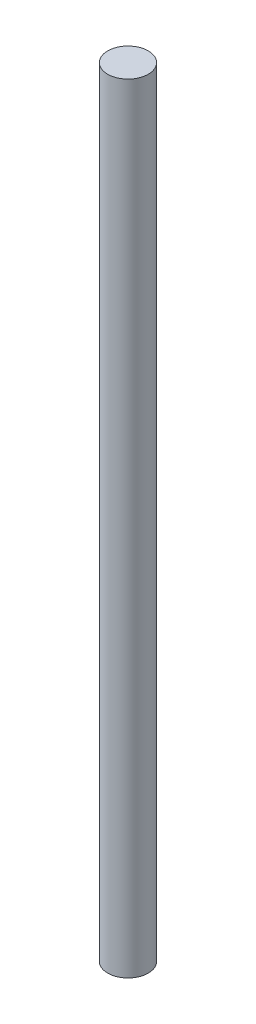
ISO-10303-21;
HEADER;
FILE_DESCRIPTION(('STEP AP214'),'2;1');
FILE_NAME('part.step','',(''),(''),'','','');
FILE_SCHEMA(('AUTOMOTIVE_DESIGN { 1 0 10303 214 1 1 1 1 }'));
ENDSEC;
DATA;
#1=APPLICATION_CONTEXT('core data for automotive mechanical design processes');
#2=APPLICATION_PROTOCOL_DEFINITION('international standard','automotive_design',2000,#1);
#3=PRODUCT_CONTEXT('',#1,'mechanical');
#4=PRODUCT('Part','Part','',(#3));
#5=PRODUCT_RELATED_PRODUCT_CATEGORY('part','',(#4));
#6=PRODUCT_DEFINITION_FORMATION('','',#4);
#7=PRODUCT_DEFINITION_CONTEXT('part definition',#1,'design');
#8=PRODUCT_DEFINITION('design','',#6,#7);
#9=PRODUCT_DEFINITION_SHAPE('','',#8);
#10=(LENGTH_UNIT() NAMED_UNIT(*) SI_UNIT(.MILLI.,.METRE.));
#11=(NAMED_UNIT(*) PLANE_ANGLE_UNIT() SI_UNIT($,.RADIAN.));
#12=(NAMED_UNIT(*) SI_UNIT($,.STERADIAN.) SOLID_ANGLE_UNIT());
#13=UNCERTAINTY_MEASURE_WITH_UNIT(LENGTH_MEASURE(1.E-05),#10,'distance_accuracy_value','');
#14=(GEOMETRIC_REPRESENTATION_CONTEXT(3) GLOBAL_UNCERTAINTY_ASSIGNED_CONTEXT((#13)) GLOBAL_UNIT_ASSIGNED_CONTEXT((#10,
#11,#12)) REPRESENTATION_CONTEXT('',''));
#15=CARTESIAN_POINT('',(0.,0.,0.));
#16=DIRECTION('',(0.,0.,1.));
#17=DIRECTION('',(1.,0.,0.));
#18=AXIS2_PLACEMENT_3D('',#15,#16,#17);
#19=CARTESIAN_POINT('',(0.,152.4,0.));
#20=DIRECTION('',(0.,-1.,0.));
#21=DIRECTION('',(0.,0.,-1.));
#22=AXIS2_PLACEMENT_3D('',#19,#20,#21);
#23=CYLINDRICAL_SURFACE('',#22,3.96875);
#24=CARTESIAN_POINT('',(0.,152.4,0.));
#25=DIRECTION('',(0.,1.,0.));
#26=DIRECTION('',(0.,0.,1.));
#27=AXIS2_PLACEMENT_3D('',#24,#25,#26);
#28=CIRCLE('',#27,3.96875);
#29=CARTESIAN_POINT('',(0.,152.4,3.96875));
#30=VERTEX_POINT('',#29);
#31=EDGE_CURVE('E10',#30,#30,#28,.T.);
#32=ORIENTED_EDGE('',*,*,#31,.F.);
#33=EDGE_LOOP('',(#32));
#34=FACE_BOUND('',#33,.T.);
#35=CARTESIAN_POINT('',(0.,0.,0.));
#36=DIRECTION('',(0.,1.,0.));
#37=DIRECTION('',(0.,0.,1.));
#38=AXIS2_PLACEMENT_3D('',#35,#36,#37);
#39=CIRCLE('',#38,3.96875);
#40=CARTESIAN_POINT('',(0.,0.,3.96875));
#41=VERTEX_POINT('',#40);
#42=EDGE_CURVE('E34',#41,#41,#39,.T.);
#43=ORIENTED_EDGE('',*,*,#42,.T.);
#44=EDGE_LOOP('',(#43));
#45=FACE_BOUND('',#44,.T.);
#46=ADVANCED_FACE('F31',(#34,#45),#23,.T.);
#47=CARTESIAN_POINT('',(0.,152.4,0.));
#48=DIRECTION('',(0.,1.,0.));
#49=DIRECTION('',(0.,0.,1.));
#50=AXIS2_PLACEMENT_3D('',#47,#48,#49);
#51=PLANE('',#50);
#52=ORIENTED_EDGE('',*,*,#31,.T.);
#53=EDGE_LOOP('',(#52));
#54=FACE_BOUND('',#53,.T.);
#55=ADVANCED_FACE('F46',(#54),#51,.T.);
#56=CARTESIAN_POINT('',(0.,0.,0.));
#57=DIRECTION('',(0.,1.,0.));
#58=DIRECTION('',(0.,0.,1.));
#59=AXIS2_PLACEMENT_3D('',#56,#57,#58);
#60=PLANE('',#59);
#61=ORIENTED_EDGE('',*,*,#42,.F.);
#62=EDGE_LOOP('',(#61));
#63=FACE_BOUND('',#62,.T.);
#64=ADVANCED_FACE('F44',(#63),#60,.F.);
#65=CLOSED_SHELL('',(#46,#55,#64));
#66=MANIFOLD_SOLID_BREP('B2',#65);
#67=ADVANCED_BREP_SHAPE_REPRESENTATION('',(#18,#66),#14);
#68=SHAPE_DEFINITION_REPRESENTATION(#9,#67);
ENDSEC;
END-ISO-10303-21;
